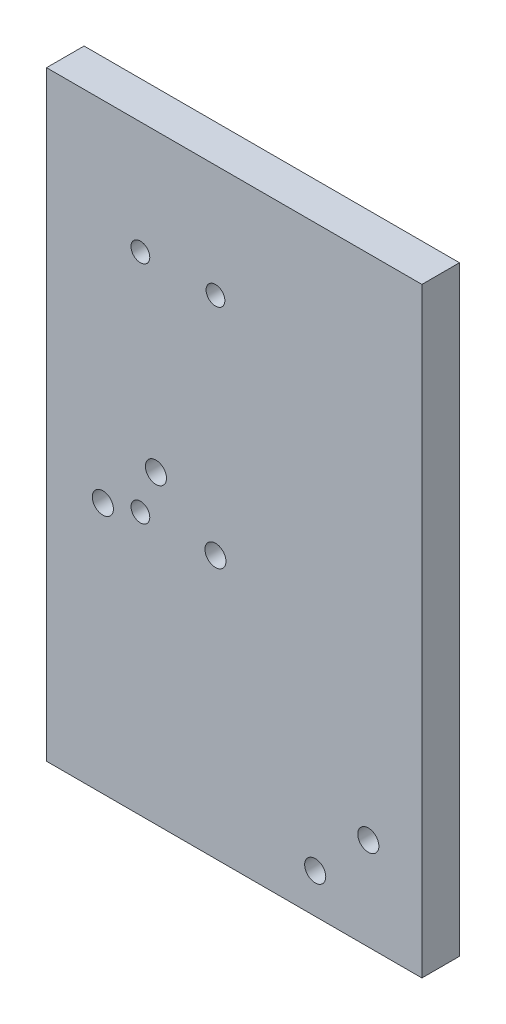
ISO-10303-21;
HEADER;
FILE_DESCRIPTION(('STEP AP214'),'2;1');
FILE_NAME('part.step','',(''),(''),'','','');
FILE_SCHEMA(('AUTOMOTIVE_DESIGN { 1 0 10303 214 1 1 1 1 }'));
ENDSEC;
DATA;
#1=APPLICATION_CONTEXT('core data for automotive mechanical design processes');
#2=APPLICATION_PROTOCOL_DEFINITION('international standard','automotive_design',2000,#1);
#3=PRODUCT_CONTEXT('',#1,'mechanical');
#4=PRODUCT('Part','Part','',(#3));
#5=PRODUCT_RELATED_PRODUCT_CATEGORY('part','',(#4));
#6=PRODUCT_DEFINITION_FORMATION('','',#4);
#7=PRODUCT_DEFINITION_CONTEXT('part definition',#1,'design');
#8=PRODUCT_DEFINITION('design','',#6,#7);
#9=PRODUCT_DEFINITION_SHAPE('','',#8);
#10=(LENGTH_UNIT() NAMED_UNIT(*) SI_UNIT(.MILLI.,.METRE.));
#11=(NAMED_UNIT(*) PLANE_ANGLE_UNIT() SI_UNIT($,.RADIAN.));
#12=(NAMED_UNIT(*) SI_UNIT($,.STERADIAN.) SOLID_ANGLE_UNIT());
#13=UNCERTAINTY_MEASURE_WITH_UNIT(LENGTH_MEASURE(1.E-05),#10,'distance_accuracy_value','');
#14=(GEOMETRIC_REPRESENTATION_CONTEXT(3) GLOBAL_UNCERTAINTY_ASSIGNED_CONTEXT((#13)) GLOBAL_UNIT_ASSIGNED_CONTEXT((#10,
#11,#12)) REPRESENTATION_CONTEXT('',''));
#15=CARTESIAN_POINT('',(0.,0.,0.));
#16=DIRECTION('',(0.,0.,1.));
#17=DIRECTION('',(1.,0.,0.));
#18=AXIS2_PLACEMENT_3D('',#15,#16,#17);
#19=CARTESIAN_POINT('',(145.297967631509,276.547614912356,12.7));
#20=DIRECTION('',(0.,0.,-1.));
#21=DIRECTION('',(-1.,0.,0.));
#22=AXIS2_PLACEMENT_3D('',#19,#20,#21);
#23=CYLINDRICAL_SURFACE('',#22,3.56870000000002);
#24=CARTESIAN_POINT('',(145.297967631509,276.547614912356,12.7));
#25=DIRECTION('',(0.,0.,1.));
#26=DIRECTION('',(1.,0.,0.));
#27=AXIS2_PLACEMENT_3D('',#24,#25,#26);
#28=CIRCLE('',#27,3.56870000000002);
#29=CARTESIAN_POINT('',(148.866667631509,276.547614912356,12.7));
#30=VERTEX_POINT('',#29);
#31=EDGE_CURVE('E186',#30,#30,#28,.T.);
#32=ORIENTED_EDGE('',*,*,#31,.T.);
#33=EDGE_LOOP('',(#32));
#34=FACE_BOUND('',#33,.T.);
#35=CARTESIAN_POINT('',(145.297967631509,276.547614912356,7.1374));
#36=DIRECTION('',(0.,0.,-1.));
#37=DIRECTION('',(-1.,0.,0.));
#38=AXIS2_PLACEMENT_3D('',#35,#36,#37);
#39=CIRCLE('',#38,3.56870000000002);
#40=CARTESIAN_POINT('',(141.729267631509,276.547614912356,7.1374));
#41=VERTEX_POINT('',#40);
#42=EDGE_CURVE('E50',#41,#41,#39,.T.);
#43=ORIENTED_EDGE('',*,*,#42,.T.);
#44=EDGE_LOOP('',(#43));
#45=FACE_BOUND('',#44,.T.);
#46=ADVANCED_FACE('F46',(#34,#45),#23,.F.);
#47=CARTESIAN_POINT('',(163.258479873647,294.508127154494,12.7));
#48=DIRECTION('',(0.,0.,-1.));
#49=DIRECTION('',(-1.,0.,0.));
#50=AXIS2_PLACEMENT_3D('',#47,#48,#49);
#51=CYLINDRICAL_SURFACE('',#50,3.56870000000002);
#52=CARTESIAN_POINT('',(163.258479873647,294.508127154494,12.7));
#53=DIRECTION('',(0.,0.,1.));
#54=DIRECTION('',(1.,0.,0.));
#55=AXIS2_PLACEMENT_3D('',#52,#53,#54);
#56=CIRCLE('',#55,3.56870000000002);
#57=CARTESIAN_POINT('',(166.827179873647,294.508127154494,12.7));
#58=VERTEX_POINT('',#57);
#59=EDGE_CURVE('E117',#58,#58,#56,.T.);
#60=ORIENTED_EDGE('',*,*,#59,.T.);
#61=EDGE_LOOP('',(#60));
#62=FACE_BOUND('',#61,.T.);
#63=CARTESIAN_POINT('',(163.258479873647,294.508127154494,7.1374));
#64=DIRECTION('',(0.,0.,-1.));
#65=DIRECTION('',(-1.,0.,0.));
#66=AXIS2_PLACEMENT_3D('',#63,#64,#65);
#67=CIRCLE('',#66,3.56870000000002);
#68=CARTESIAN_POINT('',(159.689779873647,294.508127154494,7.1374));
#69=VERTEX_POINT('',#68);
#70=EDGE_CURVE('E132',#69,#69,#67,.T.);
#71=ORIENTED_EDGE('',*,*,#70,.T.);
#72=EDGE_LOOP('',(#71));
#73=FACE_BOUND('',#72,.T.);
#74=ADVANCED_FACE('F192',(#62,#73),#51,.F.);
#75=CARTESIAN_POINT('',(73.4559186629557,348.389663880909,12.7));
#76=DIRECTION('',(0.,0.,-1.));
#77=DIRECTION('',(-1.,0.,0.));
#78=AXIS2_PLACEMENT_3D('',#75,#76,#77);
#79=CYLINDRICAL_SURFACE('',#78,3.56870000000001);
#80=CARTESIAN_POINT('',(73.4559186629557,348.389663880909,12.7));
#81=DIRECTION('',(0.,0.,1.));
#82=DIRECTION('',(1.,0.,0.));
#83=AXIS2_PLACEMENT_3D('',#80,#81,#82);
#84=CIRCLE('',#83,3.56870000000001);
#85=CARTESIAN_POINT('',(77.0246186629557,348.389663880909,12.7));
#86=VERTEX_POINT('',#85);
#87=EDGE_CURVE('E178',#86,#86,#84,.T.);
#88=ORIENTED_EDGE('',*,*,#87,.T.);
#89=EDGE_LOOP('',(#88));
#90=FACE_BOUND('',#89,.T.);
#91=CARTESIAN_POINT('',(73.4559186629557,348.389663880909,7.1374));
#92=DIRECTION('',(0.,0.,-1.));
#93=DIRECTION('',(-1.,0.,0.));
#94=AXIS2_PLACEMENT_3D('',#91,#92,#93);
#95=CIRCLE('',#94,3.56870000000001);
#96=CARTESIAN_POINT('',(69.8872186629557,348.389663880909,7.1374));
#97=VERTEX_POINT('',#96);
#98=EDGE_CURVE('E128',#97,#97,#95,.T.);
#99=ORIENTED_EDGE('',*,*,#98,.T.);
#100=EDGE_LOOP('',(#99));
#101=FACE_BOUND('',#100,.T.);
#102=ADVANCED_FACE('F205',(#90,#101),#79,.F.);
#103=CARTESIAN_POINT('',(91.4164309050941,366.350176123047,12.7));
#104=DIRECTION('',(0.,0.,-1.));
#105=DIRECTION('',(-1.,0.,0.));
#106=AXIS2_PLACEMENT_3D('',#103,#104,#105);
#107=CYLINDRICAL_SURFACE('',#106,3.56870000000001);
#108=CARTESIAN_POINT('',(91.4164309050941,366.350176123047,12.7));
#109=DIRECTION('',(0.,0.,1.));
#110=DIRECTION('',(1.,0.,0.));
#111=AXIS2_PLACEMENT_3D('',#108,#109,#110);
#112=CIRCLE('',#111,3.56870000000001);
#113=CARTESIAN_POINT('',(94.9851309050941,366.350176123047,12.7));
#114=VERTEX_POINT('',#113);
#115=EDGE_CURVE('E183',#114,#114,#112,.T.);
#116=ORIENTED_EDGE('',*,*,#115,.T.);
#117=EDGE_LOOP('',(#116));
#118=FACE_BOUND('',#117,.T.);
#119=CARTESIAN_POINT('',(91.4164309050941,366.350176123047,7.1374));
#120=DIRECTION('',(0.,0.,-1.));
#121=DIRECTION('',(-1.,0.,0.));
#122=AXIS2_PLACEMENT_3D('',#119,#120,#121);
#123=CIRCLE('',#122,3.56870000000001);
#124=CARTESIAN_POINT('',(87.8477309050941,366.350176123047,7.1374));
#125=VERTEX_POINT('',#124);
#126=EDGE_CURVE('E123',#125,#125,#123,.T.);
#127=ORIENTED_EDGE('',*,*,#126,.T.);
#128=EDGE_LOOP('',(#127));
#129=FACE_BOUND('',#128,.T.);
#130=ADVANCED_FACE('F196',(#118,#129),#107,.F.);
#131=CARTESIAN_POINT('',(0.,0.,12.7));
#132=DIRECTION('',(0.,0.,1.));
#133=DIRECTION('',(1.,0.,0.));
#134=AXIS2_PLACEMENT_3D('',#131,#132,#133);
#135=PLANE('',#134);
#136=CARTESIAN_POINT('',(86.1559186629557,352.077819458662,12.7));
#137=DIRECTION('',(0.,0.,1.));
#138=DIRECTION('',(1.,0.,0.));
#139=AXIS2_PLACEMENT_3D('',#136,#137,#138);
#140=CIRCLE('',#139,3.175);
#141=CARTESIAN_POINT('',(89.3309186629557,352.077819458662,12.7));
#142=VERTEX_POINT('',#141);
#143=EDGE_CURVE('E163',#142,#142,#140,.T.);
#144=ORIENTED_EDGE('',*,*,#143,.F.);
#145=EDGE_LOOP('',(#144));
#146=FACE_BOUND('',#145,.T.);
#147=CARTESIAN_POINT('',(86.1559186629557,428.277819458662,12.7));
#148=DIRECTION('',(0.,0.,1.));
#149=DIRECTION('',(1.,0.,0.));
#150=AXIS2_PLACEMENT_3D('',#147,#148,#149);
#151=CIRCLE('',#150,3.175);
#152=CARTESIAN_POINT('',(89.3309186629557,428.277819458662,12.7));
#153=VERTEX_POINT('',#152);
#154=EDGE_CURVE('E175',#153,#153,#151,.T.);
#155=ORIENTED_EDGE('',*,*,#154,.F.);
#156=EDGE_LOOP('',(#155));
#157=FACE_BOUND('',#156,.T.);
#158=ORIENTED_EDGE('',*,*,#115,.F.);
#159=EDGE_LOOP('',(#158));
#160=FACE_BOUND('',#159,.T.);
#161=ORIENTED_EDGE('',*,*,#59,.F.);
#162=EDGE_LOOP('',(#161));
#163=FACE_BOUND('',#162,.T.);
#164=DIRECTION('',(0.,-1.,0.));
#165=VECTOR('',#164,1.);
#166=CARTESIAN_POINT('',(54.4059186629557,466.377819458662,12.7));
#167=LINE('',#166,#165);
#168=CARTESIAN_POINT('',(54.4059186629557,466.377819458662,12.7));
#169=VERTEX_POINT('',#168);
#170=CARTESIAN_POINT('',(54.4059186629557,263.176118488614,12.7));
#171=VERTEX_POINT('',#170);
#172=EDGE_CURVE('E101',#169,#171,#167,.T.);
#173=ORIENTED_EDGE('',*,*,#172,.T.);
#174=DIRECTION('',(1.,0.,0.));
#175=VECTOR('',#174,1.);
#176=CARTESIAN_POINT('',(54.4059186629557,263.176118488614,12.7));
#177=LINE('',#176,#175);
#178=CARTESIAN_POINT('',(181.396955275244,263.176118488614,12.7));
#179=VERTEX_POINT('',#178);
#180=EDGE_CURVE('E95',#171,#179,#177,.T.);
#181=ORIENTED_EDGE('',*,*,#180,.T.);
#182=DIRECTION('',(0.,1.,0.));
#183=VECTOR('',#182,1.);
#184=CARTESIAN_POINT('',(181.396955275244,263.176118488614,12.7));
#185=LINE('',#184,#183);
#186=CARTESIAN_POINT('',(181.396955275244,466.377819458662,12.7));
#187=VERTEX_POINT('',#186);
#188=EDGE_CURVE('E99',#179,#187,#185,.T.);
#189=ORIENTED_EDGE('',*,*,#188,.T.);
#190=DIRECTION('',(-1.,0.,0.));
#191=VECTOR('',#190,1.);
#192=CARTESIAN_POINT('',(54.4059186629557,466.377819458662,12.7));
#193=LINE('',#192,#191);
#194=EDGE_CURVE('E65',#187,#169,#193,.T.);
#195=ORIENTED_EDGE('',*,*,#194,.T.);
#196=EDGE_LOOP('',(#173,#181,#189,#195));
#197=FACE_BOUND('',#196,.T.);
#198=ORIENTED_EDGE('',*,*,#31,.F.);
#199=EDGE_LOOP('',(#198));
#200=FACE_BOUND('',#199,.T.);
#201=ORIENTED_EDGE('',*,*,#87,.F.);
#202=EDGE_LOOP('',(#201));
#203=FACE_BOUND('',#202,.T.);
#204=CARTESIAN_POINT('',(111.555918662956,428.277819458662,12.7));
#205=DIRECTION('',(0.,0.,1.));
#206=DIRECTION('',(1.,0.,0.));
#207=AXIS2_PLACEMENT_3D('',#204,#205,#206);
#208=CIRCLE('',#207,3.175);
#209=CARTESIAN_POINT('',(114.730918662956,428.277819458662,12.7));
#210=VERTEX_POINT('',#209);
#211=EDGE_CURVE('E169',#210,#210,#208,.T.);
#212=ORIENTED_EDGE('',*,*,#211,.F.);
#213=EDGE_LOOP('',(#212));
#214=FACE_BOUND('',#213,.T.);
#215=CARTESIAN_POINT('',(111.555918662956,352.077819458662,12.7));
#216=DIRECTION('',(0.,0.,1.));
#217=DIRECTION('',(1.,0.,0.));
#218=AXIS2_PLACEMENT_3D('',#215,#216,#217);
#219=CIRCLE('',#218,3.556);
#220=CARTESIAN_POINT('',(115.111918662956,352.077819458662,12.7));
#221=VERTEX_POINT('',#220);
#222=EDGE_CURVE('E157',#221,#221,#219,.T.);
#223=ORIENTED_EDGE('',*,*,#222,.F.);
#224=EDGE_LOOP('',(#223));
#225=FACE_BOUND('',#224,.T.);
#226=ADVANCED_FACE('F96',(#146,#157,#160,#163,#197,#200,#203,#214,#225),#135,.T.);
#227=CARTESIAN_POINT('',(0.,0.,0.));
#228=DIRECTION('',(0.,0.,1.));
#229=DIRECTION('',(1.,0.,0.));
#230=AXIS2_PLACEMENT_3D('',#227,#228,#229);
#231=PLANE('',#230);
#232=CARTESIAN_POINT('',(145.297967631509,276.547614912356,0.));
#233=DIRECTION('',(0.,0.,-1.));
#234=DIRECTION('',(-1.,0.,0.));
#235=AXIS2_PLACEMENT_3D('',#232,#233,#234);
#236=CIRCLE('',#235,5.54989999999998);
#237=CARTESIAN_POINT('',(139.748067631509,276.547614912356,0.));
#238=VERTEX_POINT('',#237);
#239=EDGE_CURVE('E148',#238,#238,#236,.T.);
#240=ORIENTED_EDGE('',*,*,#239,.F.);
#241=EDGE_LOOP('',(#240));
#242=FACE_BOUND('',#241,.T.);
#243=CARTESIAN_POINT('',(163.258479873647,294.508127154494,0.));
#244=DIRECTION('',(0.,0.,-1.));
#245=DIRECTION('',(-1.,0.,0.));
#246=AXIS2_PLACEMENT_3D('',#243,#244,#245);
#247=CIRCLE('',#246,5.54989999999998);
#248=CARTESIAN_POINT('',(157.708579873647,294.508127154494,0.));
#249=VERTEX_POINT('',#248);
#250=EDGE_CURVE('E141',#249,#249,#247,.T.);
#251=ORIENTED_EDGE('',*,*,#250,.F.);
#252=EDGE_LOOP('',(#251));
#253=FACE_BOUND('',#252,.T.);
#254=CARTESIAN_POINT('',(73.4559186629557,348.389663880909,0.));
#255=DIRECTION('',(0.,0.,-1.));
#256=DIRECTION('',(-1.,0.,0.));
#257=AXIS2_PLACEMENT_3D('',#254,#255,#256);
#258=CIRCLE('',#257,5.5499);
#259=CARTESIAN_POINT('',(67.9060186629557,348.389663880909,0.));
#260=VERTEX_POINT('',#259);
#261=EDGE_CURVE('E134',#260,#260,#258,.T.);
#262=ORIENTED_EDGE('',*,*,#261,.F.);
#263=EDGE_LOOP('',(#262));
#264=FACE_BOUND('',#263,.T.);
#265=CARTESIAN_POINT('',(91.4164309050941,366.350176123047,0.));
#266=DIRECTION('',(0.,0.,-1.));
#267=DIRECTION('',(-1.,0.,0.));
#268=AXIS2_PLACEMENT_3D('',#265,#266,#267);
#269=CIRCLE('',#268,5.5499);
#270=CARTESIAN_POINT('',(85.8665309050941,366.350176123047,0.));
#271=VERTEX_POINT('',#270);
#272=EDGE_CURVE('E130',#271,#271,#269,.T.);
#273=ORIENTED_EDGE('',*,*,#272,.F.);
#274=EDGE_LOOP('',(#273));
#275=FACE_BOUND('',#274,.T.);
#276=CARTESIAN_POINT('',(86.1559186629557,352.077819458662,0.));
#277=DIRECTION('',(0.,0.,1.));
#278=DIRECTION('',(1.,0.,0.));
#279=AXIS2_PLACEMENT_3D('',#276,#277,#278);
#280=CIRCLE('',#279,3.175);
#281=CARTESIAN_POINT('',(89.3309186629557,352.077819458662,0.));
#282=VERTEX_POINT('',#281);
#283=EDGE_CURVE('E160',#282,#282,#280,.T.);
#284=ORIENTED_EDGE('',*,*,#283,.T.);
#285=EDGE_LOOP('',(#284));
#286=FACE_BOUND('',#285,.T.);
#287=CARTESIAN_POINT('',(86.1559186629557,428.277819458662,0.));
#288=DIRECTION('',(0.,0.,1.));
#289=DIRECTION('',(1.,0.,0.));
#290=AXIS2_PLACEMENT_3D('',#287,#288,#289);
#291=CIRCLE('',#290,3.175);
#292=CARTESIAN_POINT('',(89.3309186629557,428.277819458662,0.));
#293=VERTEX_POINT('',#292);
#294=EDGE_CURVE('E172',#293,#293,#291,.T.);
#295=ORIENTED_EDGE('',*,*,#294,.T.);
#296=EDGE_LOOP('',(#295));
#297=FACE_BOUND('',#296,.T.);
#298=DIRECTION('',(0.,-1.,0.));
#299=VECTOR('',#298,1.);
#300=CARTESIAN_POINT('',(54.4059186629557,466.377819458662,0.));
#301=LINE('',#300,#299);
#302=CARTESIAN_POINT('',(54.4059186629557,466.377819458662,0.));
#303=VERTEX_POINT('',#302);
#304=CARTESIAN_POINT('',(54.4059186629557,263.176118488614,0.));
#305=VERTEX_POINT('',#304);
#306=EDGE_CURVE('E114',#303,#305,#301,.T.);
#307=ORIENTED_EDGE('',*,*,#306,.F.);
#308=DIRECTION('',(-1.,0.,0.));
#309=VECTOR('',#308,1.);
#310=CARTESIAN_POINT('',(54.4059186629557,466.377819458662,0.));
#311=LINE('',#310,#309);
#312=CARTESIAN_POINT('',(181.396955275244,466.377819458662,0.));
#313=VERTEX_POINT('',#312);
#314=EDGE_CURVE('E88',#313,#303,#311,.T.);
#315=ORIENTED_EDGE('',*,*,#314,.F.);
#316=DIRECTION('',(0.,1.,0.));
#317=VECTOR('',#316,1.);
#318=CARTESIAN_POINT('',(181.396955275244,263.176118488614,0.));
#319=LINE('',#318,#317);
#320=CARTESIAN_POINT('',(181.396955275244,263.176118488614,0.));
#321=VERTEX_POINT('',#320);
#322=EDGE_CURVE('E82',#321,#313,#319,.T.);
#323=ORIENTED_EDGE('',*,*,#322,.F.);
#324=DIRECTION('',(1.,0.,0.));
#325=VECTOR('',#324,1.);
#326=CARTESIAN_POINT('',(54.4059186629557,263.176118488614,0.));
#327=LINE('',#326,#325);
#328=EDGE_CURVE('E105',#305,#321,#327,.T.);
#329=ORIENTED_EDGE('',*,*,#328,.F.);
#330=EDGE_LOOP('',(#307,#315,#323,#329));
#331=FACE_BOUND('',#330,.T.);
#332=CARTESIAN_POINT('',(111.555918662956,428.277819458662,0.));
#333=DIRECTION('',(0.,0.,1.));
#334=DIRECTION('',(1.,0.,0.));
#335=AXIS2_PLACEMENT_3D('',#332,#333,#334);
#336=CIRCLE('',#335,3.175);
#337=CARTESIAN_POINT('',(114.730918662956,428.277819458662,0.));
#338=VERTEX_POINT('',#337);
#339=EDGE_CURVE('E166',#338,#338,#336,.T.);
#340=ORIENTED_EDGE('',*,*,#339,.T.);
#341=EDGE_LOOP('',(#340));
#342=FACE_BOUND('',#341,.T.);
#343=CARTESIAN_POINT('',(111.555918662956,352.077819458662,0.));
#344=DIRECTION('',(0.,0.,1.));
#345=DIRECTION('',(1.,0.,0.));
#346=AXIS2_PLACEMENT_3D('',#343,#344,#345);
#347=CIRCLE('',#346,3.556);
#348=CARTESIAN_POINT('',(115.111918662956,352.077819458662,0.));
#349=VERTEX_POINT('',#348);
#350=EDGE_CURVE('E126',#349,#349,#347,.T.);
#351=ORIENTED_EDGE('',*,*,#350,.T.);
#352=EDGE_LOOP('',(#351));
#353=FACE_BOUND('',#352,.T.);
#354=ADVANCED_FACE('F195',(#242,#253,#264,#275,#286,#297,#331,#342,#353),#231,.F.);
#355=CARTESIAN_POINT('',(54.4059186629557,466.377819458662,12.7));
#356=DIRECTION('',(1.,0.,0.));
#357=DIRECTION('',(0.,0.,-1.));
#358=AXIS2_PLACEMENT_3D('',#355,#356,#357);
#359=PLANE('',#358);
#360=ORIENTED_EDGE('',*,*,#306,.T.);
#361=DIRECTION('',(0.,0.,-1.));
#362=VECTOR('',#361,1.);
#363=CARTESIAN_POINT('',(54.4059186629557,263.176118488614,12.7));
#364=LINE('',#363,#362);
#365=EDGE_CURVE('E13',#171,#305,#364,.T.);
#366=ORIENTED_EDGE('',*,*,#365,.F.);
#367=ORIENTED_EDGE('',*,*,#172,.F.);
#368=DIRECTION('',(0.,0.,-1.));
#369=VECTOR('',#368,1.);
#370=CARTESIAN_POINT('',(54.4059186629557,466.377819458662,12.7));
#371=LINE('',#370,#369);
#372=EDGE_CURVE('E110',#169,#303,#371,.T.);
#373=ORIENTED_EDGE('',*,*,#372,.T.);
#374=EDGE_LOOP('',(#360,#366,#367,#373));
#375=FACE_BOUND('',#374,.T.);
#376=ADVANCED_FACE('F48',(#375),#359,.F.);
#377=CARTESIAN_POINT('',(54.4059186629557,263.176118488614,12.7));
#378=DIRECTION('',(0.,1.,0.));
#379=DIRECTION('',(0.,0.,1.));
#380=AXIS2_PLACEMENT_3D('',#377,#378,#379);
#381=PLANE('',#380);
#382=ORIENTED_EDGE('',*,*,#328,.T.);
#383=DIRECTION('',(0.,0.,-1.));
#384=VECTOR('',#383,1.);
#385=CARTESIAN_POINT('',(181.396955275244,263.176118488614,12.7));
#386=LINE('',#385,#384);
#387=EDGE_CURVE('E56',#179,#321,#386,.T.);
#388=ORIENTED_EDGE('',*,*,#387,.F.);
#389=ORIENTED_EDGE('',*,*,#180,.F.);
#390=ORIENTED_EDGE('',*,*,#365,.T.);
#391=EDGE_LOOP('',(#382,#388,#389,#390));
#392=FACE_BOUND('',#391,.T.);
#393=ADVANCED_FACE('F104',(#392),#381,.F.);
#394=CARTESIAN_POINT('',(181.396955275244,263.176118488614,12.7));
#395=DIRECTION('',(-1.,0.,0.));
#396=DIRECTION('',(0.,0.,1.));
#397=AXIS2_PLACEMENT_3D('',#394,#395,#396);
#398=PLANE('',#397);
#399=ORIENTED_EDGE('',*,*,#322,.T.);
#400=DIRECTION('',(0.,0.,-1.));
#401=VECTOR('',#400,1.);
#402=CARTESIAN_POINT('',(181.396955275244,466.377819458662,12.7));
#403=LINE('',#402,#401);
#404=EDGE_CURVE('E106',#187,#313,#403,.T.);
#405=ORIENTED_EDGE('',*,*,#404,.F.);
#406=ORIENTED_EDGE('',*,*,#188,.F.);
#407=ORIENTED_EDGE('',*,*,#387,.T.);
#408=EDGE_LOOP('',(#399,#405,#406,#407));
#409=FACE_BOUND('',#408,.T.);
#410=ADVANCED_FACE('F108',(#409),#398,.F.);
#411=CARTESIAN_POINT('',(54.4059186629557,466.377819458662,12.7));
#412=DIRECTION('',(0.,-1.,0.));
#413=DIRECTION('',(0.,0.,-1.));
#414=AXIS2_PLACEMENT_3D('',#411,#412,#413);
#415=PLANE('',#414);
#416=ORIENTED_EDGE('',*,*,#314,.T.);
#417=ORIENTED_EDGE('',*,*,#372,.F.);
#418=ORIENTED_EDGE('',*,*,#194,.F.);
#419=ORIENTED_EDGE('',*,*,#404,.T.);
#420=EDGE_LOOP('',(#416,#417,#418,#419));
#421=FACE_BOUND('',#420,.T.);
#422=ADVANCED_FACE('F226',(#421),#415,.F.);
#423=CARTESIAN_POINT('',(86.1559186629557,428.277819458662,12.7));
#424=DIRECTION('',(0.,0.,-1.));
#425=DIRECTION('',(-1.,0.,0.));
#426=AXIS2_PLACEMENT_3D('',#423,#424,#425);
#427=CYLINDRICAL_SURFACE('',#426,3.175);
#428=ORIENTED_EDGE('',*,*,#154,.T.);
#429=EDGE_LOOP('',(#428));
#430=FACE_BOUND('',#429,.T.);
#431=ORIENTED_EDGE('',*,*,#294,.F.);
#432=EDGE_LOOP('',(#431));
#433=FACE_BOUND('',#432,.T.);
#434=ADVANCED_FACE('F222',(#430,#433),#427,.F.);
#435=CARTESIAN_POINT('',(111.555918662956,428.277819458662,12.7));
#436=DIRECTION('',(0.,0.,-1.));
#437=DIRECTION('',(-1.,0.,0.));
#438=AXIS2_PLACEMENT_3D('',#435,#436,#437);
#439=CYLINDRICAL_SURFACE('',#438,3.175);
#440=ORIENTED_EDGE('',*,*,#211,.T.);
#441=EDGE_LOOP('',(#440));
#442=FACE_BOUND('',#441,.T.);
#443=ORIENTED_EDGE('',*,*,#339,.F.);
#444=EDGE_LOOP('',(#443));
#445=FACE_BOUND('',#444,.T.);
#446=ADVANCED_FACE('F225',(#442,#445),#439,.F.);
#447=CARTESIAN_POINT('',(86.1559186629557,352.077819458662,12.7));
#448=DIRECTION('',(0.,0.,-1.));
#449=DIRECTION('',(-1.,0.,0.));
#450=AXIS2_PLACEMENT_3D('',#447,#448,#449);
#451=CYLINDRICAL_SURFACE('',#450,3.175);
#452=ORIENTED_EDGE('',*,*,#143,.T.);
#453=EDGE_LOOP('',(#452));
#454=FACE_BOUND('',#453,.T.);
#455=ORIENTED_EDGE('',*,*,#283,.F.);
#456=EDGE_LOOP('',(#455));
#457=FACE_BOUND('',#456,.T.);
#458=ADVANCED_FACE('F230',(#454,#457),#451,.F.);
#459=CARTESIAN_POINT('',(111.555918662956,352.077819458662,12.7));
#460=DIRECTION('',(0.,0.,-1.));
#461=DIRECTION('',(-1.,0.,0.));
#462=AXIS2_PLACEMENT_3D('',#459,#460,#461);
#463=CYLINDRICAL_SURFACE('',#462,3.556);
#464=ORIENTED_EDGE('',*,*,#222,.T.);
#465=EDGE_LOOP('',(#464));
#466=FACE_BOUND('',#465,.T.);
#467=ORIENTED_EDGE('',*,*,#350,.F.);
#468=EDGE_LOOP('',(#467));
#469=FACE_BOUND('',#468,.T.);
#470=ADVANCED_FACE('F234',(#466,#469),#463,.F.);
#471=CARTESIAN_POINT('',(91.4164309050941,366.350176123047,7.1374));
#472=DIRECTION('',(0.,0.,-1.));
#473=DIRECTION('',(-1.,0.,0.));
#474=AXIS2_PLACEMENT_3D('',#471,#472,#473);
#475=CYLINDRICAL_SURFACE('',#474,5.5499);
#476=CARTESIAN_POINT('',(91.4164309050941,366.350176123047,7.1374));
#477=DIRECTION('',(0.,0.,-1.));
#478=DIRECTION('',(-1.,0.,0.));
#479=AXIS2_PLACEMENT_3D('',#476,#477,#478);
#480=CIRCLE('',#479,5.5499);
#481=CARTESIAN_POINT('',(85.8665309050941,366.350176123047,7.1374));
#482=VERTEX_POINT('',#481);
#483=EDGE_CURVE('E127',#482,#482,#480,.T.);
#484=ORIENTED_EDGE('',*,*,#483,.F.);
#485=EDGE_LOOP('',(#484));
#486=FACE_BOUND('',#485,.T.);
#487=ORIENTED_EDGE('',*,*,#272,.T.);
#488=EDGE_LOOP('',(#487));
#489=FACE_BOUND('',#488,.T.);
#490=ADVANCED_FACE('F238',(#486,#489),#475,.F.);
#491=CARTESIAN_POINT('',(91.4164309050941,366.350176123047,7.1374));
#492=DIRECTION('',(0.,0.,-1.));
#493=DIRECTION('',(-1.,0.,0.));
#494=AXIS2_PLACEMENT_3D('',#491,#492,#493);
#495=PLANE('',#494);
#496=ORIENTED_EDGE('',*,*,#126,.F.);
#497=EDGE_LOOP('',(#496));
#498=FACE_BOUND('',#497,.T.);
#499=ORIENTED_EDGE('',*,*,#483,.T.);
#500=EDGE_LOOP('',(#499));
#501=FACE_BOUND('',#500,.T.);
#502=ADVANCED_FACE('F242',(#498,#501),#495,.T.);
#503=CARTESIAN_POINT('',(73.4559186629557,348.389663880909,7.1374));
#504=DIRECTION('',(0.,0.,-1.));
#505=DIRECTION('',(-1.,0.,0.));
#506=AXIS2_PLACEMENT_3D('',#503,#504,#505);
#507=CYLINDRICAL_SURFACE('',#506,5.5499);
#508=CARTESIAN_POINT('',(73.4559186629557,348.389663880909,7.1374));
#509=DIRECTION('',(0.,0.,-1.));
#510=DIRECTION('',(-1.,0.,0.));
#511=AXIS2_PLACEMENT_3D('',#508,#509,#510);
#512=CIRCLE('',#511,5.5499);
#513=CARTESIAN_POINT('',(67.9060186629557,348.389663880909,7.1374));
#514=VERTEX_POINT('',#513);
#515=EDGE_CURVE('E131',#514,#514,#512,.T.);
#516=ORIENTED_EDGE('',*,*,#515,.F.);
#517=EDGE_LOOP('',(#516));
#518=FACE_BOUND('',#517,.T.);
#519=ORIENTED_EDGE('',*,*,#261,.T.);
#520=EDGE_LOOP('',(#519));
#521=FACE_BOUND('',#520,.T.);
#522=ADVANCED_FACE('F246',(#518,#521),#507,.F.);
#523=CARTESIAN_POINT('',(73.4559186629557,348.389663880909,7.1374));
#524=DIRECTION('',(0.,0.,-1.));
#525=DIRECTION('',(-1.,0.,0.));
#526=AXIS2_PLACEMENT_3D('',#523,#524,#525);
#527=PLANE('',#526);
#528=ORIENTED_EDGE('',*,*,#98,.F.);
#529=EDGE_LOOP('',(#528));
#530=FACE_BOUND('',#529,.T.);
#531=ORIENTED_EDGE('',*,*,#515,.T.);
#532=EDGE_LOOP('',(#531));
#533=FACE_BOUND('',#532,.T.);
#534=ADVANCED_FACE('F250',(#530,#533),#527,.T.);
#535=CARTESIAN_POINT('',(163.258479873647,294.508127154494,7.1374));
#536=DIRECTION('',(0.,0.,-1.));
#537=DIRECTION('',(-1.,0.,0.));
#538=AXIS2_PLACEMENT_3D('',#535,#536,#537);
#539=CYLINDRICAL_SURFACE('',#538,5.54989999999998);
#540=CARTESIAN_POINT('',(163.258479873647,294.508127154494,7.1374));
#541=DIRECTION('',(0.,0.,-1.));
#542=DIRECTION('',(-1.,0.,0.));
#543=AXIS2_PLACEMENT_3D('',#540,#541,#542);
#544=CIRCLE('',#543,5.54989999999998);
#545=CARTESIAN_POINT('',(157.708579873647,294.508127154494,7.1374));
#546=VERTEX_POINT('',#545);
#547=EDGE_CURVE('E135',#546,#546,#544,.T.);
#548=ORIENTED_EDGE('',*,*,#547,.F.);
#549=EDGE_LOOP('',(#548));
#550=FACE_BOUND('',#549,.T.);
#551=ORIENTED_EDGE('',*,*,#250,.T.);
#552=EDGE_LOOP('',(#551));
#553=FACE_BOUND('',#552,.T.);
#554=ADVANCED_FACE('F254',(#550,#553),#539,.F.);
#555=CARTESIAN_POINT('',(163.258479873647,294.508127154494,7.1374));
#556=DIRECTION('',(0.,0.,-1.));
#557=DIRECTION('',(-1.,0.,0.));
#558=AXIS2_PLACEMENT_3D('',#555,#556,#557);
#559=PLANE('',#558);
#560=ORIENTED_EDGE('',*,*,#70,.F.);
#561=EDGE_LOOP('',(#560));
#562=FACE_BOUND('',#561,.T.);
#563=ORIENTED_EDGE('',*,*,#547,.T.);
#564=EDGE_LOOP('',(#563));
#565=FACE_BOUND('',#564,.T.);
#566=ADVANCED_FACE('F258',(#562,#565),#559,.T.);
#567=CARTESIAN_POINT('',(145.297967631509,276.547614912356,7.1374));
#568=DIRECTION('',(0.,0.,-1.));
#569=DIRECTION('',(-1.,0.,0.));
#570=AXIS2_PLACEMENT_3D('',#567,#568,#569);
#571=CYLINDRICAL_SURFACE('',#570,5.54989999999998);
#572=CARTESIAN_POINT('',(145.297967631509,276.547614912356,7.1374));
#573=DIRECTION('',(0.,0.,-1.));
#574=DIRECTION('',(-1.,0.,0.));
#575=AXIS2_PLACEMENT_3D('',#572,#573,#574);
#576=CIRCLE('',#575,5.54989999999998);
#577=CARTESIAN_POINT('',(139.748067631509,276.547614912356,7.1374));
#578=VERTEX_POINT('',#577);
#579=EDGE_CURVE('E277',#578,#578,#576,.T.);
#580=ORIENTED_EDGE('',*,*,#579,.F.);
#581=EDGE_LOOP('',(#580));
#582=FACE_BOUND('',#581,.T.);
#583=ORIENTED_EDGE('',*,*,#239,.T.);
#584=EDGE_LOOP('',(#583));
#585=FACE_BOUND('',#584,.T.);
#586=ADVANCED_FACE('F262',(#582,#585),#571,.F.);
#587=CARTESIAN_POINT('',(145.297967631509,276.547614912356,7.1374));
#588=DIRECTION('',(0.,0.,-1.));
#589=DIRECTION('',(-1.,0.,0.));
#590=AXIS2_PLACEMENT_3D('',#587,#588,#589);
#591=PLANE('',#590);
#592=ORIENTED_EDGE('',*,*,#42,.F.);
#593=EDGE_LOOP('',(#592));
#594=FACE_BOUND('',#593,.T.);
#595=ORIENTED_EDGE('',*,*,#579,.T.);
#596=EDGE_LOOP('',(#595));
#597=FACE_BOUND('',#596,.T.);
#598=ADVANCED_FACE('F266',(#594,#597),#591,.T.);
#599=CLOSED_SHELL('',(#46,#74,#102,#130,#226,#354,#376,#393,#410,#422,#434,#446,#458,#470,#490,
#502,#522,#534,#554,#566,#586,#598));
#600=MANIFOLD_SOLID_BREP('B2',#599);
#601=ADVANCED_BREP_SHAPE_REPRESENTATION('',(#18,#600),#14);
#602=SHAPE_DEFINITION_REPRESENTATION(#9,#601);
ENDSEC;
END-ISO-10303-21;
